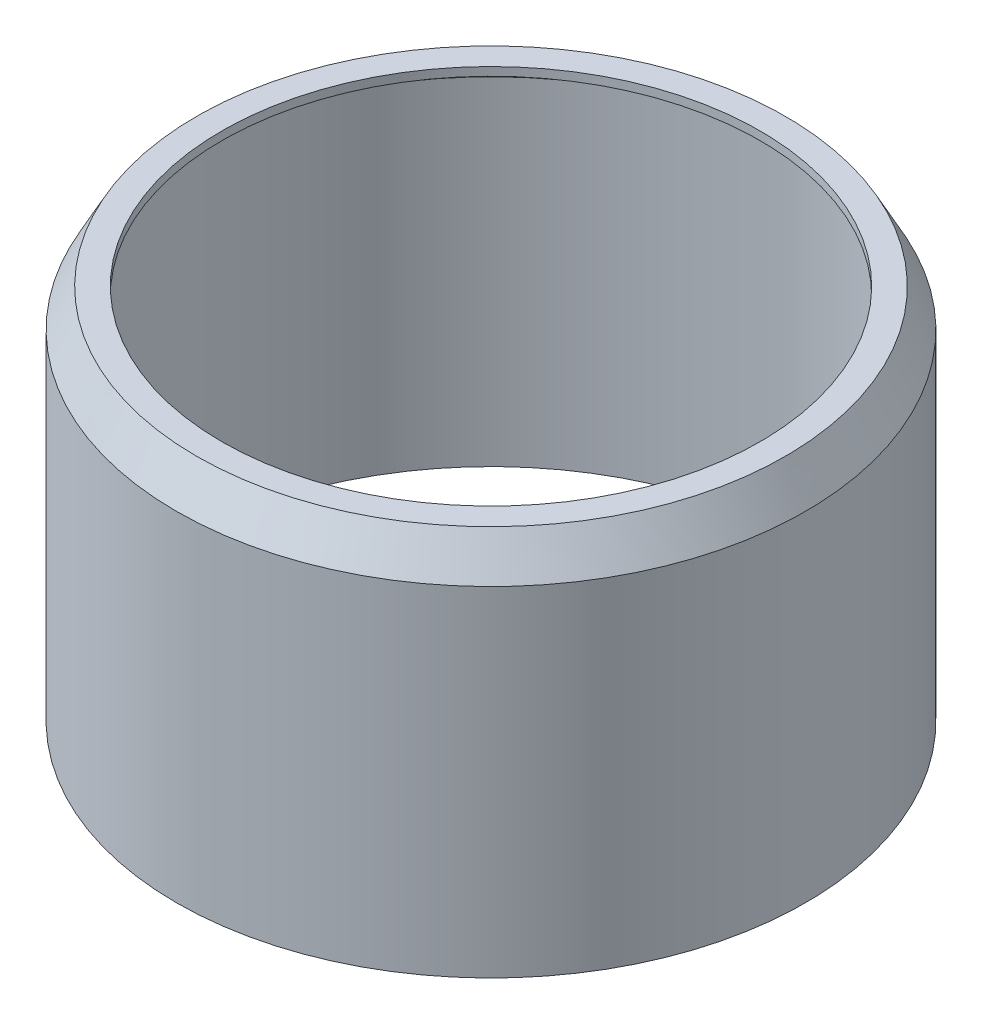
ISO-10303-21;
HEADER;
FILE_DESCRIPTION(('STEP AP214'),'2;1');
FILE_NAME('part.step','',(''),(''),'','','');
FILE_SCHEMA(('AUTOMOTIVE_DESIGN { 1 0 10303 214 1 1 1 1 }'));
ENDSEC;
DATA;
#1=APPLICATION_CONTEXT('core data for automotive mechanical design processes');
#2=APPLICATION_PROTOCOL_DEFINITION('international standard','automotive_design',2000,#1);
#3=PRODUCT_CONTEXT('',#1,'mechanical');
#4=PRODUCT('Part','Part','',(#3));
#5=PRODUCT_RELATED_PRODUCT_CATEGORY('part','',(#4));
#6=PRODUCT_DEFINITION_FORMATION('','',#4);
#7=PRODUCT_DEFINITION_CONTEXT('part definition',#1,'design');
#8=PRODUCT_DEFINITION('design','',#6,#7);
#9=PRODUCT_DEFINITION_SHAPE('','',#8);
#10=(LENGTH_UNIT() NAMED_UNIT(*) SI_UNIT(.MILLI.,.METRE.));
#11=(NAMED_UNIT(*) PLANE_ANGLE_UNIT() SI_UNIT($,.RADIAN.));
#12=(NAMED_UNIT(*) SI_UNIT($,.STERADIAN.) SOLID_ANGLE_UNIT());
#13=UNCERTAINTY_MEASURE_WITH_UNIT(LENGTH_MEASURE(1.E-05),#10,'distance_accuracy_value','');
#14=(GEOMETRIC_REPRESENTATION_CONTEXT(3) GLOBAL_UNCERTAINTY_ASSIGNED_CONTEXT((#13)) GLOBAL_UNIT_ASSIGNED_CONTEXT((#10,
#11,#12)) REPRESENTATION_CONTEXT('',''));
#15=CARTESIAN_POINT('',(0.,0.,0.));
#16=DIRECTION('',(0.,0.,1.));
#17=DIRECTION('',(1.,0.,0.));
#18=AXIS2_PLACEMENT_3D('',#15,#16,#17);
#19=CARTESIAN_POINT('',(0.,1.,0.));
#20=DIRECTION('',(0.,-1.,0.));
#21=DIRECTION('',(0.,0.,-1.));
#22=AXIS2_PLACEMENT_3D('',#19,#20,#21);
#23=CYLINDRICAL_SURFACE('',#22,35.);
#24=CARTESIAN_POINT('',(0.,0.,0.));
#25=DIRECTION('',(0.,1.,0.));
#26=DIRECTION('',(0.,0.,1.));
#27=AXIS2_PLACEMENT_3D('',#24,#25,#26);
#28=CIRCLE('',#27,35.);
#29=CARTESIAN_POINT('',(0.,0.,35.));
#30=VERTEX_POINT('',#29);
#31=EDGE_CURVE('E44',#30,#30,#28,.T.);
#32=ORIENTED_EDGE('',*,*,#31,.T.);
#33=EDGE_LOOP('',(#32));
#34=FACE_BOUND('',#33,.T.);
#35=CARTESIAN_POINT('',(0.,0.549668864248565,0.));
#36=DIRECTION('',(0.,-1.,0.));
#37=DIRECTION('',(0.,0.,-1.));
#38=AXIS2_PLACEMENT_3D('',#35,#36,#37);
#39=CIRCLE('',#38,35.);
#40=CARTESIAN_POINT('',(0.,0.549668864248565,-35.));
#41=VERTEX_POINT('',#40);
#42=EDGE_CURVE('E10',#41,#41,#39,.F.);
#43=ORIENTED_EDGE('',*,*,#42,.F.);
#44=EDGE_LOOP('',(#43));
#45=FACE_BOUND('',#44,.T.);
#46=ADVANCED_FACE('F37',(#34,#45),#23,.T.);
#47=CARTESIAN_POINT('',(0.,1.,0.));
#48=DIRECTION('',(0.,1.,0.));
#49=DIRECTION('',(0.,0.,1.));
#50=AXIS2_PLACEMENT_3D('',#47,#48,#49);
#51=PLANE('',#50);
#52=CARTESIAN_POINT('',(0.,1.,0.));
#53=DIRECTION('',(0.,1.,0.));
#54=DIRECTION('',(0.,0.,1.));
#55=AXIS2_PLACEMENT_3D('',#52,#53,#54);
#56=CIRCLE('',#55,35.);
#57=CARTESIAN_POINT('',(0.,1.,35.));
#58=VERTEX_POINT('',#57);
#59=EDGE_CURVE('E76',#58,#58,#56,.T.);
#60=ORIENTED_EDGE('',*,*,#59,.T.);
#61=EDGE_LOOP('',(#60));
#62=FACE_BOUND('',#61,.T.);
#63=CARTESIAN_POINT('',(0.,1.,0.));
#64=DIRECTION('',(0.,1.,0.));
#65=DIRECTION('',(0.,0.,1.));
#66=AXIS2_PLACEMENT_3D('',#63,#64,#65);
#67=CIRCLE('',#66,32.);
#68=CARTESIAN_POINT('',(0.,1.,32.));
#69=VERTEX_POINT('',#68);
#70=EDGE_CURVE('E49',#69,#69,#67,.T.);
#71=ORIENTED_EDGE('',*,*,#70,.F.);
#72=EDGE_LOOP('',(#71));
#73=FACE_BOUND('',#72,.T.);
#74=ADVANCED_FACE('F81',(#62,#73),#51,.T.);
#75=CARTESIAN_POINT('',(0.,0.,0.));
#76=DIRECTION('',(0.,1.,0.));
#77=DIRECTION('',(0.,0.,1.));
#78=AXIS2_PLACEMENT_3D('',#75,#76,#77);
#79=PLANE('',#78);
#80=ORIENTED_EDGE('',*,*,#31,.F.);
#81=EDGE_LOOP('',(#80));
#82=FACE_BOUND('',#81,.T.);
#83=CARTESIAN_POINT('',(0.,0.,0.));
#84=DIRECTION('',(0.,1.,0.));
#85=DIRECTION('',(0.,0.,1.));
#86=AXIS2_PLACEMENT_3D('',#83,#84,#85);
#87=CIRCLE('',#86,32.);
#88=CARTESIAN_POINT('',(0.,0.,32.));
#89=VERTEX_POINT('',#88);
#90=EDGE_CURVE('E54',#89,#89,#87,.T.);
#91=ORIENTED_EDGE('',*,*,#90,.T.);
#92=EDGE_LOOP('',(#91));
#93=FACE_BOUND('',#92,.T.);
#94=ADVANCED_FACE('F115',(#82,#93),#79,.F.);
#95=CARTESIAN_POINT('',(0.,1.,0.));
#96=DIRECTION('',(0.,-1.,0.));
#97=DIRECTION('',(0.,0.,-1.));
#98=AXIS2_PLACEMENT_3D('',#95,#96,#97);
#99=CYLINDRICAL_SURFACE('',#98,32.);
#100=ORIENTED_EDGE('',*,*,#70,.T.);
#101=EDGE_LOOP('',(#100));
#102=FACE_BOUND('',#101,.T.);
#103=ORIENTED_EDGE('',*,*,#90,.F.);
#104=EDGE_LOOP('',(#103));
#105=FACE_BOUND('',#104,.T.);
#106=ADVANCED_FACE('F110',(#102,#105),#99,.F.);
#107=CARTESIAN_POINT('',(0.,0.549668864248565,0.));
#108=DIRECTION('',(0.,-1.,0.));
#109=DIRECTION('',(0.,0.,-1.));
#110=AXIS2_PLACEMENT_3D('',#107,#108,#109);
#111=CONICAL_SURFACE('',#110,35.,0.459120366722299);
#112=CARTESIAN_POINT('',(0.,-3.6430986225256,0.));
#113=DIRECTION('',(0.,1.,0.));
#114=DIRECTION('',(0.,0.,1.));
#115=AXIS2_PLACEMENT_3D('',#112,#113,#114);
#116=CIRCLE('',#115,37.0727100770729);
#117=CARTESIAN_POINT('',(0.,-3.6430986225256,37.0727100770729));
#118=VERTEX_POINT('',#117);
#119=EDGE_CURVE('E59',#118,#118,#116,.T.);
#120=ORIENTED_EDGE('',*,*,#119,.F.);
#121=EDGE_LOOP('',(#120));
#122=FACE_BOUND('',#121,.T.);
#123=ORIENTED_EDGE('',*,*,#42,.T.);
#124=EDGE_LOOP('',(#123));
#125=FACE_BOUND('',#124,.T.);
#126=ADVANCED_FACE('F105',(#122,#125),#111,.F.);
#127=CARTESIAN_POINT('',(0.,0.,0.));
#128=DIRECTION('',(0.,1.,0.));
#129=DIRECTION('',(0.,0.,1.));
#130=AXIS2_PLACEMENT_3D('',#127,#128,#129);
#131=CYLINDRICAL_SURFACE('',#130,37.0727100770729);
#132=CARTESIAN_POINT('',(0.,-43.7717355534559,0.));
#133=DIRECTION('',(0.,1.,0.));
#134=DIRECTION('',(0.,0.,1.));
#135=AXIS2_PLACEMENT_3D('',#132,#133,#134);
#136=CIRCLE('',#135,37.0727100770729);
#137=CARTESIAN_POINT('',(0.,-43.7717355534559,37.0727100770729));
#138=VERTEX_POINT('',#137);
#139=EDGE_CURVE('E64',#138,#138,#136,.T.);
#140=ORIENTED_EDGE('',*,*,#139,.F.);
#141=EDGE_LOOP('',(#140));
#142=FACE_BOUND('',#141,.T.);
#143=ORIENTED_EDGE('',*,*,#119,.T.);
#144=EDGE_LOOP('',(#143));
#145=FACE_BOUND('',#144,.T.);
#146=ADVANCED_FACE('F99',(#142,#145),#131,.F.);
#147=CARTESIAN_POINT('',(37.3952089545736,-43.7717355534559,0.));
#148=DIRECTION('',(0.,1.,0.));
#149=DIRECTION('',(0.,0.,1.));
#150=AXIS2_PLACEMENT_3D('',#147,#148,#149);
#151=PLANE('',#150);
#152=CARTESIAN_POINT('',(0.,-43.7717355534559,0.));
#153=DIRECTION('',(0.,1.,0.));
#154=DIRECTION('',(0.,0.,1.));
#155=AXIS2_PLACEMENT_3D('',#152,#153,#154);
#156=CIRCLE('',#155,37.3952089545736);
#157=CARTESIAN_POINT('',(0.,-43.7717355534559,37.3952089545736));
#158=VERTEX_POINT('',#157);
#159=EDGE_CURVE('E68',#158,#158,#156,.T.);
#160=ORIENTED_EDGE('',*,*,#159,.F.);
#161=EDGE_LOOP('',(#160));
#162=FACE_BOUND('',#161,.T.);
#163=ORIENTED_EDGE('',*,*,#139,.T.);
#164=EDGE_LOOP('',(#163));
#165=FACE_BOUND('',#164,.T.);
#166=ADVANCED_FACE('F93',(#162,#165),#151,.F.);
#167=CARTESIAN_POINT('',(0.,0.,0.));
#168=DIRECTION('',(0.,1.,0.));
#169=DIRECTION('',(0.,0.,1.));
#170=AXIS2_PLACEMENT_3D('',#167,#168,#169);
#171=CYLINDRICAL_SURFACE('',#170,37.3952089545736);
#172=CARTESIAN_POINT('',(0.,-3.47030220664077,0.));
#173=DIRECTION('',(0.,1.,0.));
#174=DIRECTION('',(0.,0.,1.));
#175=AXIS2_PLACEMENT_3D('',#172,#173,#174);
#176=CIRCLE('',#175,37.3952089545736);
#177=CARTESIAN_POINT('',(0.,-3.47030220664077,37.3952089545736));
#178=VERTEX_POINT('',#177);
#179=EDGE_CURVE('E72',#178,#178,#176,.T.);
#180=ORIENTED_EDGE('',*,*,#179,.F.);
#181=EDGE_LOOP('',(#180));
#182=FACE_BOUND('',#181,.T.);
#183=ORIENTED_EDGE('',*,*,#159,.T.);
#184=EDGE_LOOP('',(#183));
#185=FACE_BOUND('',#184,.T.);
#186=ADVANCED_FACE('F87',(#182,#185),#171,.T.);
#187=CARTESIAN_POINT('',(0.,-3.47030220664077,0.));
#188=DIRECTION('',(0.,-1.,0.));
#189=DIRECTION('',(0.,0.,-1.));
#190=AXIS2_PLACEMENT_3D('',#187,#188,#189);
#191=CONICAL_SURFACE('',#190,37.3952089545736,0.491879429666951);
#192=ORIENTED_EDGE('',*,*,#59,.F.);
#193=EDGE_LOOP('',(#192));
#194=FACE_BOUND('',#193,.T.);
#195=ORIENTED_EDGE('',*,*,#179,.T.);
#196=EDGE_LOOP('',(#195));
#197=FACE_BOUND('',#196,.T.);
#198=ADVANCED_FACE('F84',(#194,#197),#191,.T.);
#199=CLOSED_SHELL('',(#46,#74,#94,#106,#126,#146,#166,#186,#198));
#200=MANIFOLD_SOLID_BREP('B2',#199);
#201=ADVANCED_BREP_SHAPE_REPRESENTATION('',(#18,#200),#14);
#202=SHAPE_DEFINITION_REPRESENTATION(#9,#201);
ENDSEC;
END-ISO-10303-21;
